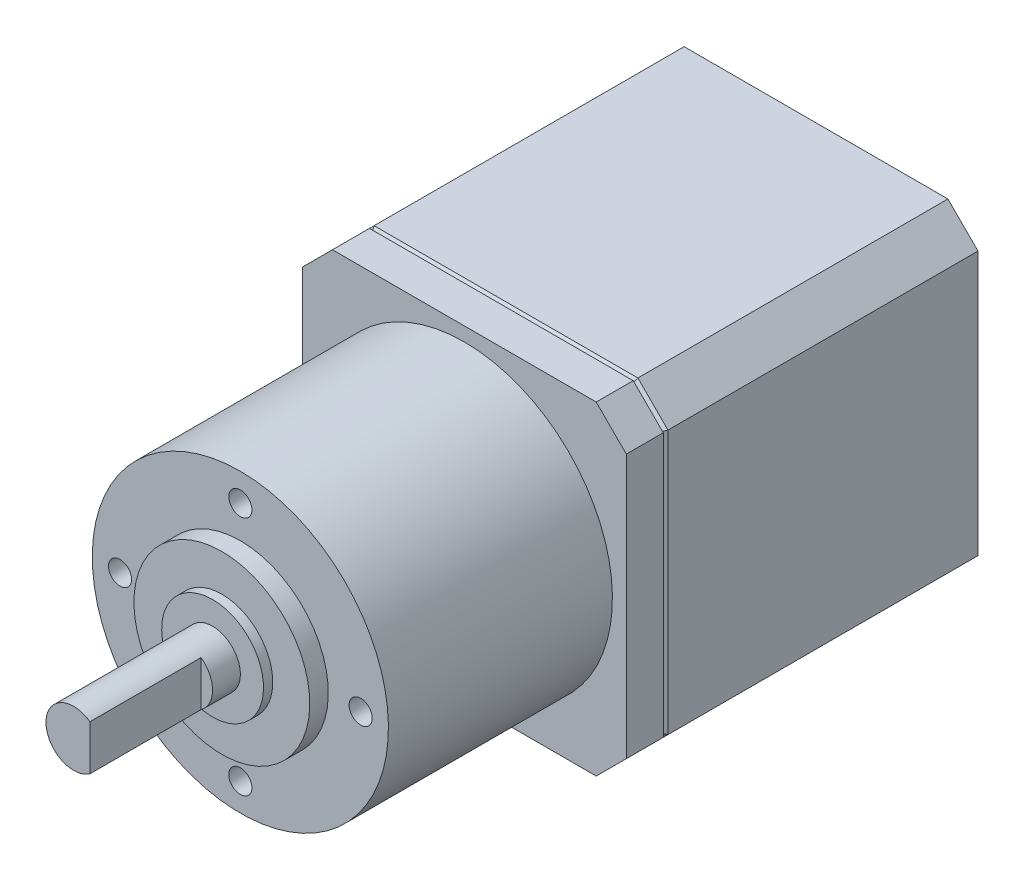
ISO-10303-21;
HEADER;
FILE_DESCRIPTION(('STEP AP214'),'2;1');
FILE_NAME('part.step','',(''),(''),'','','');
FILE_SCHEMA(('AUTOMOTIVE_DESIGN { 1 0 10303 214 1 1 1 1 }'));
ENDSEC;
DATA;
#1=APPLICATION_CONTEXT('core data for automotive mechanical design processes');
#2=APPLICATION_PROTOCOL_DEFINITION('international standard','automotive_design',2000,#1);
#3=PRODUCT_CONTEXT('',#1,'mechanical');
#4=PRODUCT('Part','Part','',(#3));
#5=PRODUCT_RELATED_PRODUCT_CATEGORY('part','',(#4));
#6=PRODUCT_DEFINITION_FORMATION('','',#4);
#7=PRODUCT_DEFINITION_CONTEXT('part definition',#1,'design');
#8=PRODUCT_DEFINITION('design','',#6,#7);
#9=PRODUCT_DEFINITION_SHAPE('','',#8);
#10=(LENGTH_UNIT() NAMED_UNIT(*) SI_UNIT(.MILLI.,.METRE.));
#11=(NAMED_UNIT(*) PLANE_ANGLE_UNIT() SI_UNIT($,.RADIAN.));
#12=(NAMED_UNIT(*) SI_UNIT($,.STERADIAN.) SOLID_ANGLE_UNIT());
#13=UNCERTAINTY_MEASURE_WITH_UNIT(LENGTH_MEASURE(1.E-05),#10,'distance_accuracy_value','');
#14=(GEOMETRIC_REPRESENTATION_CONTEXT(3) GLOBAL_UNCERTAINTY_ASSIGNED_CONTEXT((#13)) GLOBAL_UNIT_ASSIGNED_CONTEXT((#10,
#11,#12)) REPRESENTATION_CONTEXT('',''));
#15=CARTESIAN_POINT('',(0.,0.,0.));
#16=DIRECTION('',(0.,0.,1.));
#17=DIRECTION('',(1.,0.,0.));
#18=AXIS2_PLACEMENT_3D('',#15,#16,#17);
#19=CARTESIAN_POINT('',(0.,0.,68.2));
#20=DIRECTION('',(0.,0.,1.));
#21=DIRECTION('',(1.,0.,0.));
#22=AXIS2_PLACEMENT_3D('',#19,#20,#21);
#23=PLANE('',#22);
#24=CARTESIAN_POINT('',(0.,0.,68.2));
#25=DIRECTION('',(0.,0.,-1.));
#26=DIRECTION('',(0.,1.,0.));
#27=AXIS2_PLACEMENT_3D('',#24,#25,#26);
#28=CIRCLE('',#27,3.);
#29=CARTESIAN_POINT('',(1.75,2.43669858620224,68.2));
#30=VERTEX_POINT('',#29);
#31=CARTESIAN_POINT('',(1.74999999999999,-2.43669858620225,68.2));
#32=VERTEX_POINT('',#31);
#33=EDGE_CURVE('P0_E20',#30,#32,#28,.T.);
#34=ORIENTED_EDGE('',*,*,#33,.F.);
#35=DIRECTION('',(0.,1.,0.));
#36=VECTOR('',#35,1.);
#37=CARTESIAN_POINT('',(1.75,2.43669858620224,68.2));
#38=LINE('',#37,#36);
#39=EDGE_CURVE('P0_E118',#30,#32,#38,.F.);
#40=ORIENTED_EDGE('',*,*,#39,.T.);
#41=EDGE_LOOP('',(#34,#40));
#42=FACE_BOUND('',#41,.T.);
#43=ADVANCED_FACE('P0_F17',(#42),#23,.T.);
#44=CARTESIAN_POINT('',(1.75,2.43669858620224,68.2));
#45=DIRECTION('',(-1.,0.,0.));
#46=DIRECTION('',(0.,0.,1.));
#47=AXIS2_PLACEMENT_3D('',#44,#45,#46);
#48=PLANE('',#47);
#49=DIRECTION('',(0.,0.,-1.));
#50=VECTOR('',#49,1.);
#51=CARTESIAN_POINT('',(1.74999999999999,-2.43669858620225,38.));
#52=LINE('',#51,#50);
#53=CARTESIAN_POINT('',(1.74999999999999,-2.43669858620225,80.2));
#54=VERTEX_POINT('',#53);
#55=EDGE_CURVE('P0_E112',#32,#54,#52,.F.);
#56=ORIENTED_EDGE('',*,*,#55,.F.);
#57=ORIENTED_EDGE('',*,*,#39,.F.);
#58=DIRECTION('',(0.,0.,-1.));
#59=VECTOR('',#58,1.);
#60=CARTESIAN_POINT('',(1.75,2.43669858620224,38.));
#61=LINE('',#60,#59);
#62=CARTESIAN_POINT('',(1.75,2.43669858620224,80.2));
#63=VERTEX_POINT('',#62);
#64=EDGE_CURVE('P0_E117',#63,#30,#61,.T.);
#65=ORIENTED_EDGE('',*,*,#64,.F.);
#66=DIRECTION('',(0.,-1.,0.));
#67=VECTOR('',#66,1.);
#68=CARTESIAN_POINT('',(1.75,0.,80.2));
#69=LINE('',#68,#67);
#70=EDGE_CURVE('P0_E109',#54,#63,#69,.F.);
#71=ORIENTED_EDGE('',*,*,#70,.F.);
#72=EDGE_LOOP('',(#56,#57,#65,#71));
#73=FACE_BOUND('',#72,.T.);
#74=ADVANCED_FACE('P0_F115',(#73),#48,.F.);
#75=CARTESIAN_POINT('',(0.,0.,80.2));
#76=DIRECTION('',(0.,0.,1.));
#77=DIRECTION('',(0.,-1.,0.));
#78=AXIS2_PLACEMENT_3D('',#75,#76,#77);
#79=PLANE('',#78);
#80=CARTESIAN_POINT('',(0.,0.,80.2));
#81=DIRECTION('',(0.,0.,-1.));
#82=DIRECTION('',(0.,1.,0.));
#83=AXIS2_PLACEMENT_3D('',#80,#81,#82);
#84=CIRCLE('',#83,3.);
#85=EDGE_CURVE('P0_E104',#54,#63,#84,.T.);
#86=ORIENTED_EDGE('',*,*,#85,.F.);
#87=ORIENTED_EDGE('',*,*,#70,.T.);
#88=EDGE_LOOP('',(#86,#87));
#89=FACE_BOUND('',#88,.T.);
#90=ADVANCED_FACE('P0_F108',(#89),#79,.T.);
#91=CARTESIAN_POINT('',(0.,0.,38.));
#92=DIRECTION('',(0.,0.,-1.));
#93=DIRECTION('',(0.,1.,0.));
#94=AXIS2_PLACEMENT_3D('',#91,#92,#93);
#95=CYLINDRICAL_SURFACE('',#94,3.);
#96=ORIENTED_EDGE('',*,*,#55,.T.);
#97=ORIENTED_EDGE('',*,*,#85,.T.);
#98=ORIENTED_EDGE('',*,*,#64,.T.);
#99=ORIENTED_EDGE('',*,*,#33,.T.);
#100=EDGE_LOOP('',(#96,#97,#98,#99));
#101=FACE_BOUND('',#100,.T.);
#102=CARTESIAN_POINT('',(0.,0.,65.2));
#103=DIRECTION('',(0.,0.,-1.));
#104=DIRECTION('',(0.,1.,0.));
#105=AXIS2_PLACEMENT_3D('',#102,#103,#104);
#106=CIRCLE('',#105,3.);
#107=CARTESIAN_POINT('',(0.,3.,65.2));
#108=VERTEX_POINT('',#107);
#109=EDGE_CURVE('P0_E111',#108,#108,#106,.T.);
#110=ORIENTED_EDGE('',*,*,#109,.F.);
#111=EDGE_LOOP('',(#110));
#112=FACE_BOUND('',#111,.T.);
#113=ADVANCED_FACE('P0_F120',(#101,#112),#95,.T.);
#114=CARTESIAN_POINT('',(0.,2.99999999999999,65.2));
#115=DIRECTION('',(0.,0.,1.));
#116=DIRECTION('',(0.,-1.,0.));
#117=AXIS2_PLACEMENT_3D('',#114,#115,#116);
#118=PLANE('',#117);
#119=CARTESIAN_POINT('',(0.,0.,65.2));
#120=DIRECTION('',(0.,0.,-1.));
#121=DIRECTION('',(0.,1.,0.));
#122=AXIS2_PLACEMENT_3D('',#119,#120,#121);
#123=CIRCLE('',#122,5.5);
#124=CARTESIAN_POINT('',(0.,5.5,65.2));
#125=VERTEX_POINT('',#124);
#126=EDGE_CURVE('P0_E156',#125,#125,#123,.T.);
#127=ORIENTED_EDGE('',*,*,#126,.F.);
#128=EDGE_LOOP('',(#127));
#129=FACE_BOUND('',#128,.T.);
#130=ORIENTED_EDGE('',*,*,#109,.T.);
#131=EDGE_LOOP('',(#130));
#132=FACE_BOUND('',#131,.T.);
#133=ADVANCED_FACE('P0_F162',(#129,#132),#118,.T.);
#134=CARTESIAN_POINT('',(0.,0.,38.));
#135=DIRECTION('',(0.,0.,-1.));
#136=DIRECTION('',(0.,1.,0.));
#137=AXIS2_PLACEMENT_3D('',#134,#135,#136);
#138=CYLINDRICAL_SURFACE('',#137,5.5);
#139=ORIENTED_EDGE('',*,*,#126,.T.);
#140=EDGE_LOOP('',(#139));
#141=FACE_BOUND('',#140,.T.);
#142=CARTESIAN_POINT('',(0.,0.,64.2));
#143=DIRECTION('',(0.,0.,-1.));
#144=DIRECTION('',(0.,1.,0.));
#145=AXIS2_PLACEMENT_3D('',#142,#143,#144);
#146=CIRCLE('',#145,5.5);
#147=CARTESIAN_POINT('',(0.,5.5,64.2));
#148=VERTEX_POINT('',#147);
#149=EDGE_CURVE('P0_E152',#148,#148,#146,.T.);
#150=ORIENTED_EDGE('',*,*,#149,.F.);
#151=EDGE_LOOP('',(#150));
#152=FACE_BOUND('',#151,.T.);
#153=ADVANCED_FACE('P0_F170',(#141,#152),#138,.T.);
#154=CARTESIAN_POINT('',(0.,13.,57.1999999999662));
#155=DIRECTION('',(0.,0.,1.));
#156=DIRECTION('',(0.,-1.,0.));
#157=AXIS2_PLACEMENT_3D('',#154,#155,#156);
#158=CONICAL_SURFACE('',#157,1.2499999999136,1.0297442586752);
#159=CARTESIAN_POINT('',(-5.6843418860808E-11,13.,56.4489242262027));
#160=VERTEX_POINT('',#159);
#161=VERTEX_LOOP('',#160);
#162=FACE_BOUND('',#161,.T.);
#163=CARTESIAN_POINT('',(0.,13.,57.2));
#164=DIRECTION('',(0.,0.,1.));
#165=DIRECTION('',(1.,0.,0.));
#166=AXIS2_PLACEMENT_3D('',#163,#164,#165);
#167=CIRCLE('',#166,1.25);
#168=CARTESIAN_POINT('',(1.25,13.,57.2));
#169=VERTEX_POINT('',#168);
#170=EDGE_CURVE('P0_E155',#169,#169,#167,.T.);
#171=ORIENTED_EDGE('',*,*,#170,.T.);
#172=EDGE_LOOP('',(#171));
#173=FACE_BOUND('',#172,.T.);
#174=ADVANCED_FACE('P0_F260',(#162,#173),#158,.F.);
#175=CARTESIAN_POINT('',(13.,0.,57.200000000023));
#176=DIRECTION('',(0.,0.,1.));
#177=DIRECTION('',(1.,0.,0.));
#178=AXIS2_PLACEMENT_3D('',#175,#176,#177);
#179=CONICAL_SURFACE('',#178,1.25000000000409,1.02974425861207);
#180=CARTESIAN_POINT('',(13.0000000000052,0.,56.4489242262312));
#181=VERTEX_POINT('',#180);
#182=VERTEX_LOOP('',#181);
#183=FACE_BOUND('',#182,.T.);
#184=CARTESIAN_POINT('',(13.,0.,57.2));
#185=DIRECTION('',(0.,0.,1.));
#186=DIRECTION('',(1.,0.,0.));
#187=AXIS2_PLACEMENT_3D('',#184,#185,#186);
#188=CIRCLE('',#187,1.25);
#189=CARTESIAN_POINT('',(14.25,0.,57.2));
#190=VERTEX_POINT('',#189);
#191=EDGE_CURVE('P0_E449',#190,#190,#188,.T.);
#192=ORIENTED_EDGE('',*,*,#191,.T.);
#193=EDGE_LOOP('',(#192));
#194=FACE_BOUND('',#193,.T.);
#195=ADVANCED_FACE('P0_F256',(#183,#194),#179,.F.);
#196=CARTESIAN_POINT('',(0.,-13.,57.1999999999662));
#197=DIRECTION('',(0.,0.,1.));
#198=DIRECTION('',(0.,-1.,0.));
#199=AXIS2_PLACEMENT_3D('',#196,#197,#198);
#200=CONICAL_SURFACE('',#199,1.2499999999136,1.0297442586752);
#201=CARTESIAN_POINT('',(-5.6843418860808E-11,-13.,56.4489242262027));
#202=VERTEX_POINT('',#201);
#203=VERTEX_LOOP('',#202);
#204=FACE_BOUND('',#203,.T.);
#205=CARTESIAN_POINT('',(0.,-13.,57.2));
#206=DIRECTION('',(0.,0.,1.));
#207=DIRECTION('',(1.,0.,0.));
#208=AXIS2_PLACEMENT_3D('',#205,#206,#207);
#209=CIRCLE('',#208,1.25);
#210=CARTESIAN_POINT('',(1.25,-13.,57.2));
#211=VERTEX_POINT('',#210);
#212=EDGE_CURVE('P0_E452',#211,#211,#209,.T.);
#213=ORIENTED_EDGE('',*,*,#212,.T.);
#214=EDGE_LOOP('',(#213));
#215=FACE_BOUND('',#214,.T.);
#216=ADVANCED_FACE('P0_F252',(#204,#215),#200,.F.);
#217=CARTESIAN_POINT('',(-13.,0.,57.200000000023));
#218=DIRECTION('',(0.,0.,1.));
#219=DIRECTION('',(1.,0.,0.));
#220=AXIS2_PLACEMENT_3D('',#217,#218,#219);
#221=CONICAL_SURFACE('',#220,1.24999999999363,1.02974425865817);
#222=CARTESIAN_POINT('',(-12.9999999998915,0.,56.4489242262312));
#223=VERTEX_POINT('',#222);
#224=VERTEX_LOOP('',#223);
#225=FACE_BOUND('',#224,.T.);
#226=CARTESIAN_POINT('',(-13.,0.,57.2));
#227=DIRECTION('',(0.,0.,1.));
#228=DIRECTION('',(1.,0.,0.));
#229=AXIS2_PLACEMENT_3D('',#226,#227,#228);
#230=CIRCLE('',#229,1.25);
#231=CARTESIAN_POINT('',(-11.75,0.,57.2));
#232=VERTEX_POINT('',#231);
#233=EDGE_CURVE('P0_E151',#232,#232,#230,.T.);
#234=ORIENTED_EDGE('',*,*,#233,.T.);
#235=EDGE_LOOP('',(#234));
#236=FACE_BOUND('',#235,.T.);
#237=ADVANCED_FACE('P0_F248',(#225,#236),#221,.F.);
#238=CARTESIAN_POINT('',(0.,5.5,64.2));
#239=DIRECTION('',(0.,0.,1.));
#240=DIRECTION('',(0.,-1.,0.));
#241=AXIS2_PLACEMENT_3D('',#238,#239,#240);
#242=PLANE('',#241);
#243=CARTESIAN_POINT('',(0.,0.,64.2));
#244=DIRECTION('',(0.,0.,-1.));
#245=DIRECTION('',(0.,1.,0.));
#246=AXIS2_PLACEMENT_3D('',#243,#244,#245);
#247=CIRCLE('',#246,9.5);
#248=CARTESIAN_POINT('',(0.,9.5,64.2));
#249=VERTEX_POINT('',#248);
#250=EDGE_CURVE('P0_E147',#249,#249,#247,.T.);
#251=ORIENTED_EDGE('',*,*,#250,.F.);
#252=EDGE_LOOP('',(#251));
#253=FACE_BOUND('',#252,.T.);
#254=ORIENTED_EDGE('',*,*,#149,.T.);
#255=EDGE_LOOP('',(#254));
#256=FACE_BOUND('',#255,.T.);
#257=ADVANCED_FACE('P0_F244',(#253,#256),#242,.T.);
#258=CARTESIAN_POINT('',(0.,0.,34.));
#259=DIRECTION('',(0.,0.,1.));
#260=DIRECTION('',(1.,0.,0.));
#261=AXIS2_PLACEMENT_3D('',#258,#259,#260);
#262=PLANE('',#261);
#263=DIRECTION('',(-0.707106781186548,-0.707106781186548,0.));
#264=VECTOR('',#263,1.);
#265=CARTESIAN_POINT('',(14.25,-17.5,34.));
#266=LINE('',#265,#264);
#267=CARTESIAN_POINT('',(17.5,-14.25,34.));
#268=VERTEX_POINT('',#267);
#269=CARTESIAN_POINT('',(14.25,-17.5,34.));
#270=VERTEX_POINT('',#269);
#271=EDGE_CURVE('P0_E146',#268,#270,#266,.T.);
#272=ORIENTED_EDGE('',*,*,#271,.T.);
#273=DIRECTION('',(-1.,0.,0.));
#274=VECTOR('',#273,1.);
#275=CARTESIAN_POINT('',(-14.25,-17.5,34.));
#276=LINE('',#275,#274);
#277=CARTESIAN_POINT('',(-14.25,-17.5,34.));
#278=VERTEX_POINT('',#277);
#279=EDGE_CURVE('P0_E487',#270,#278,#276,.T.);
#280=ORIENTED_EDGE('',*,*,#279,.T.);
#281=DIRECTION('',(-0.707106781186548,0.707106781186548,0.));
#282=VECTOR('',#281,1.);
#283=CARTESIAN_POINT('',(-17.5,-14.25,34.));
#284=LINE('',#283,#282);
#285=CARTESIAN_POINT('',(-17.5,-14.25,34.));
#286=VERTEX_POINT('',#285);
#287=EDGE_CURVE('P0_E482',#278,#286,#284,.T.);
#288=ORIENTED_EDGE('',*,*,#287,.T.);
#289=DIRECTION('',(0.,1.,0.));
#290=VECTOR('',#289,1.);
#291=CARTESIAN_POINT('',(-17.5,14.25,34.));
#292=LINE('',#291,#290);
#293=CARTESIAN_POINT('',(-17.5,14.25,34.));
#294=VERTEX_POINT('',#293);
#295=EDGE_CURVE('P0_E477',#286,#294,#292,.T.);
#296=ORIENTED_EDGE('',*,*,#295,.T.);
#297=DIRECTION('',(0.707106781186548,0.707106781186548,0.));
#298=VECTOR('',#297,1.);
#299=CARTESIAN_POINT('',(-14.25,17.5,34.));
#300=LINE('',#299,#298);
#301=CARTESIAN_POINT('',(-14.25,17.5,34.));
#302=VERTEX_POINT('',#301);
#303=EDGE_CURVE('P0_E472',#294,#302,#300,.T.);
#304=ORIENTED_EDGE('',*,*,#303,.T.);
#305=DIRECTION('',(1.,0.,0.));
#306=VECTOR('',#305,1.);
#307=CARTESIAN_POINT('',(14.25,17.5,34.));
#308=LINE('',#307,#306);
#309=CARTESIAN_POINT('',(14.25,17.5,34.));
#310=VERTEX_POINT('',#309);
#311=EDGE_CURVE('P0_E467',#302,#310,#308,.T.);
#312=ORIENTED_EDGE('',*,*,#311,.T.);
#313=DIRECTION('',(0.707106781186548,-0.707106781186548,0.));
#314=VECTOR('',#313,1.);
#315=CARTESIAN_POINT('',(17.5,14.25,34.));
#316=LINE('',#315,#314);
#317=CARTESIAN_POINT('',(17.5,14.25,34.));
#318=VERTEX_POINT('',#317);
#319=EDGE_CURVE('P0_E462',#310,#318,#316,.T.);
#320=ORIENTED_EDGE('',*,*,#319,.T.);
#321=DIRECTION('',(0.,1.,0.));
#322=VECTOR('',#321,1.);
#323=CARTESIAN_POINT('',(17.5,-14.25,34.));
#324=LINE('',#323,#322);
#325=EDGE_CURVE('P0_E150',#318,#268,#324,.F.);
#326=ORIENTED_EDGE('',*,*,#325,.T.);
#327=EDGE_LOOP('',(#272,#280,#288,#296,#304,#312,#320,#326));
#328=FACE_BOUND('',#327,.T.);
#329=ADVANCED_FACE('P0_F240',(#328),#262,.F.);
#330=CARTESIAN_POINT('',(0.,13.,62.2));
#331=DIRECTION('',(0.,0.,1.));
#332=DIRECTION('',(1.,0.,0.));
#333=AXIS2_PLACEMENT_3D('',#330,#331,#332);
#334=CYLINDRICAL_SURFACE('',#333,1.25);
#335=CARTESIAN_POINT('',(0.,13.,62.2));
#336=DIRECTION('',(0.,0.,1.));
#337=DIRECTION('',(1.,0.,0.));
#338=AXIS2_PLACEMENT_3D('',#335,#336,#337);
#339=CIRCLE('',#338,1.25);
#340=CARTESIAN_POINT('',(1.25,13.,62.2));
#341=VERTEX_POINT('',#340);
#342=EDGE_CURVE('P0_E143',#341,#341,#339,.F.);
#343=ORIENTED_EDGE('',*,*,#342,.F.);
#344=EDGE_LOOP('',(#343));
#345=FACE_BOUND('',#344,.T.);
#346=ORIENTED_EDGE('',*,*,#170,.F.);
#347=EDGE_LOOP('',(#346));
#348=FACE_BOUND('',#347,.T.);
#349=ADVANCED_FACE('P0_F236',(#345,#348),#334,.F.);
#350=CARTESIAN_POINT('',(13.,0.,62.2));
#351=DIRECTION('',(0.,0.,1.));
#352=DIRECTION('',(1.,0.,0.));
#353=AXIS2_PLACEMENT_3D('',#350,#351,#352);
#354=CYLINDRICAL_SURFACE('',#353,1.25);
#355=CARTESIAN_POINT('',(13.,0.,62.2));
#356=DIRECTION('',(0.,0.,1.));
#357=DIRECTION('',(1.,0.,0.));
#358=AXIS2_PLACEMENT_3D('',#355,#356,#357);
#359=CIRCLE('',#358,1.25);
#360=CARTESIAN_POINT('',(14.25,0.,62.2));
#361=VERTEX_POINT('',#360);
#362=EDGE_CURVE('P0_E140',#361,#361,#359,.F.);
#363=ORIENTED_EDGE('',*,*,#362,.F.);
#364=EDGE_LOOP('',(#363));
#365=FACE_BOUND('',#364,.T.);
#366=ORIENTED_EDGE('',*,*,#191,.F.);
#367=EDGE_LOOP('',(#366));
#368=FACE_BOUND('',#367,.T.);
#369=ADVANCED_FACE('P0_F232',(#365,#368),#354,.F.);
#370=CARTESIAN_POINT('',(0.,-13.,62.2));
#371=DIRECTION('',(0.,0.,1.));
#372=DIRECTION('',(1.,0.,0.));
#373=AXIS2_PLACEMENT_3D('',#370,#371,#372);
#374=CYLINDRICAL_SURFACE('',#373,1.25);
#375=CARTESIAN_POINT('',(0.,-13.,62.2));
#376=DIRECTION('',(0.,0.,1.));
#377=DIRECTION('',(1.,0.,0.));
#378=AXIS2_PLACEMENT_3D('',#375,#376,#377);
#379=CIRCLE('',#378,1.25);
#380=CARTESIAN_POINT('',(1.25,-13.,62.2));
#381=VERTEX_POINT('',#380);
#382=EDGE_CURVE('P0_E137',#381,#381,#379,.F.);
#383=ORIENTED_EDGE('',*,*,#382,.F.);
#384=EDGE_LOOP('',(#383));
#385=FACE_BOUND('',#384,.T.);
#386=ORIENTED_EDGE('',*,*,#212,.F.);
#387=EDGE_LOOP('',(#386));
#388=FACE_BOUND('',#387,.T.);
#389=ADVANCED_FACE('P0_F228',(#385,#388),#374,.F.);
#390=CARTESIAN_POINT('',(-13.,0.,62.2));
#391=DIRECTION('',(0.,0.,1.));
#392=DIRECTION('',(1.,0.,0.));
#393=AXIS2_PLACEMENT_3D('',#390,#391,#392);
#394=CYLINDRICAL_SURFACE('',#393,1.25);
#395=CARTESIAN_POINT('',(-13.,0.,62.2));
#396=DIRECTION('',(0.,0.,1.));
#397=DIRECTION('',(1.,0.,0.));
#398=AXIS2_PLACEMENT_3D('',#395,#396,#397);
#399=CIRCLE('',#398,1.25);
#400=CARTESIAN_POINT('',(-11.75,0.,62.2));
#401=VERTEX_POINT('',#400);
#402=EDGE_CURVE('P0_E134',#401,#401,#399,.F.);
#403=ORIENTED_EDGE('',*,*,#402,.F.);
#404=EDGE_LOOP('',(#403));
#405=FACE_BOUND('',#404,.T.);
#406=ORIENTED_EDGE('',*,*,#233,.F.);
#407=EDGE_LOOP('',(#406));
#408=FACE_BOUND('',#407,.T.);
#409=ADVANCED_FACE('P0_F224',(#405,#408),#394,.F.);
#410=CARTESIAN_POINT('',(0.,0.,38.));
#411=DIRECTION('',(0.,0.,-1.));
#412=DIRECTION('',(0.,1.,0.));
#413=AXIS2_PLACEMENT_3D('',#410,#411,#412);
#414=CYLINDRICAL_SURFACE('',#413,9.5);
#415=ORIENTED_EDGE('',*,*,#250,.T.);
#416=EDGE_LOOP('',(#415));
#417=FACE_BOUND('',#416,.T.);
#418=CARTESIAN_POINT('',(0.,0.,62.2));
#419=DIRECTION('',(0.,0.,-1.));
#420=DIRECTION('',(0.,1.,0.));
#421=AXIS2_PLACEMENT_3D('',#418,#419,#420);
#422=CIRCLE('',#421,9.5);
#423=CARTESIAN_POINT('',(0.,9.5,62.2));
#424=VERTEX_POINT('',#423);
#425=EDGE_CURVE('P0_E130',#424,#424,#422,.T.);
#426=ORIENTED_EDGE('',*,*,#425,.F.);
#427=EDGE_LOOP('',(#426));
#428=FACE_BOUND('',#427,.T.);
#429=ADVANCED_FACE('P0_F220',(#417,#428),#414,.T.);
#430=CARTESIAN_POINT('',(17.5,-14.25,38.));
#431=DIRECTION('',(-1.,0.,0.));
#432=DIRECTION('',(0.,0.,1.));
#433=AXIS2_PLACEMENT_3D('',#430,#431,#432);
#434=PLANE('',#433);
#435=DIRECTION('',(0.,0.,1.));
#436=VECTOR('',#435,1.);
#437=CARTESIAN_POINT('',(17.5,14.25,38.));
#438=LINE('',#437,#436);
#439=CARTESIAN_POINT('',(17.5,14.25,38.));
#440=VERTEX_POINT('',#439);
#441=EDGE_CURVE('P0_E460',#318,#440,#438,.T.);
#442=ORIENTED_EDGE('',*,*,#441,.T.);
#443=DIRECTION('',(0.,1.,0.));
#444=VECTOR('',#443,1.);
#445=CARTESIAN_POINT('',(17.5,0.,38.));
#446=LINE('',#445,#444);
#447=CARTESIAN_POINT('',(17.5,-14.25,38.));
#448=VERTEX_POINT('',#447);
#449=EDGE_CURVE('P0_E133',#448,#440,#446,.T.);
#450=ORIENTED_EDGE('',*,*,#449,.F.);
#451=DIRECTION('',(0.,0.,1.));
#452=VECTOR('',#451,1.);
#453=CARTESIAN_POINT('',(17.5,-14.25,38.));
#454=LINE('',#453,#452);
#455=EDGE_CURVE('P0_E491',#448,#268,#454,.F.);
#456=ORIENTED_EDGE('',*,*,#455,.T.);
#457=ORIENTED_EDGE('',*,*,#325,.F.);
#458=EDGE_LOOP('',(#442,#450,#456,#457));
#459=FACE_BOUND('',#458,.T.);
#460=ADVANCED_FACE('P0_F216',(#459),#434,.F.);
#461=CARTESIAN_POINT('',(17.5,14.25,38.));
#462=DIRECTION('',(-0.707106781186548,-0.707106781186548,0.));
#463=DIRECTION('',(0.707106781186548,-0.707106781186548,0.));
#464=AXIS2_PLACEMENT_3D('',#461,#462,#463);
#465=PLANE('',#464);
#466=DIRECTION('',(0.,0.,1.));
#467=VECTOR('',#466,1.);
#468=CARTESIAN_POINT('',(14.25,17.5,38.));
#469=LINE('',#468,#467);
#470=CARTESIAN_POINT('',(14.25,17.5,38.));
#471=VERTEX_POINT('',#470);
#472=EDGE_CURVE('P0_E465',#310,#471,#469,.T.);
#473=ORIENTED_EDGE('',*,*,#472,.T.);
#474=DIRECTION('',(-0.707106781186547,0.707106781186547,0.));
#475=VECTOR('',#474,1.);
#476=CARTESIAN_POINT('',(17.5,14.25,38.));
#477=LINE('',#476,#475);
#478=EDGE_CURVE('P0_E498',#440,#471,#477,.T.);
#479=ORIENTED_EDGE('',*,*,#478,.F.);
#480=ORIENTED_EDGE('',*,*,#441,.F.);
#481=ORIENTED_EDGE('',*,*,#319,.F.);
#482=EDGE_LOOP('',(#473,#479,#480,#481));
#483=FACE_BOUND('',#482,.T.);
#484=ADVANCED_FACE('P0_F212',(#483),#465,.F.);
#485=CARTESIAN_POINT('',(14.25,17.5,38.));
#486=DIRECTION('',(0.,-1.,0.));
#487=DIRECTION('',(1.,0.,0.));
#488=AXIS2_PLACEMENT_3D('',#485,#486,#487);
#489=PLANE('',#488);
#490=DIRECTION('',(0.,0.,1.));
#491=VECTOR('',#490,1.);
#492=CARTESIAN_POINT('',(-14.25,17.5,38.));
#493=LINE('',#492,#491);
#494=CARTESIAN_POINT('',(-14.25,17.5,38.));
#495=VERTEX_POINT('',#494);
#496=EDGE_CURVE('P0_E470',#302,#495,#493,.T.);
#497=ORIENTED_EDGE('',*,*,#496,.T.);
#498=DIRECTION('',(1.,0.,0.));
#499=VECTOR('',#498,1.);
#500=CARTESIAN_POINT('',(0.,17.5,38.));
#501=LINE('',#500,#499);
#502=EDGE_CURVE('P0_E501',#471,#495,#501,.F.);
#503=ORIENTED_EDGE('',*,*,#502,.F.);
#504=ORIENTED_EDGE('',*,*,#472,.F.);
#505=ORIENTED_EDGE('',*,*,#311,.F.);
#506=EDGE_LOOP('',(#497,#503,#504,#505));
#507=FACE_BOUND('',#506,.T.);
#508=ADVANCED_FACE('P0_F208',(#507),#489,.F.);
#509=CARTESIAN_POINT('',(-14.25,17.5,38.));
#510=DIRECTION('',(0.707106781186548,-0.707106781186548,0.));
#511=DIRECTION('',(0.707106781186548,0.707106781186548,0.));
#512=AXIS2_PLACEMENT_3D('',#509,#510,#511);
#513=PLANE('',#512);
#514=DIRECTION('',(0.,0.,-1.));
#515=VECTOR('',#514,1.);
#516=CARTESIAN_POINT('',(-17.5,14.25,38.));
#517=LINE('',#516,#515);
#518=CARTESIAN_POINT('',(-17.5,14.25,38.));
#519=VERTEX_POINT('',#518);
#520=EDGE_CURVE('P0_E475',#294,#519,#517,.F.);
#521=ORIENTED_EDGE('',*,*,#520,.T.);
#522=DIRECTION('',(-0.707106781186547,-0.707106781186547,0.));
#523=VECTOR('',#522,1.);
#524=CARTESIAN_POINT('',(-14.25,17.5,38.));
#525=LINE('',#524,#523);
#526=EDGE_CURVE('P0_E504',#495,#519,#525,.T.);
#527=ORIENTED_EDGE('',*,*,#526,.F.);
#528=ORIENTED_EDGE('',*,*,#496,.F.);
#529=ORIENTED_EDGE('',*,*,#303,.F.);
#530=EDGE_LOOP('',(#521,#527,#528,#529));
#531=FACE_BOUND('',#530,.T.);
#532=ADVANCED_FACE('P0_F204',(#531),#513,.F.);
#533=CARTESIAN_POINT('',(-17.5,14.25,38.));
#534=DIRECTION('',(1.,0.,0.));
#535=DIRECTION('',(0.,0.,-1.));
#536=AXIS2_PLACEMENT_3D('',#533,#534,#535);
#537=PLANE('',#536);
#538=DIRECTION('',(0.,0.,1.));
#539=VECTOR('',#538,1.);
#540=CARTESIAN_POINT('',(-17.5,-14.25,38.));
#541=LINE('',#540,#539);
#542=CARTESIAN_POINT('',(-17.5,-14.25,38.));
#543=VERTEX_POINT('',#542);
#544=EDGE_CURVE('P0_E480',#286,#543,#541,.T.);
#545=ORIENTED_EDGE('',*,*,#544,.T.);
#546=DIRECTION('',(0.,1.,0.));
#547=VECTOR('',#546,1.);
#548=CARTESIAN_POINT('',(-17.5,0.,38.));
#549=LINE('',#548,#547);
#550=EDGE_CURVE('P0_E507',#519,#543,#549,.F.);
#551=ORIENTED_EDGE('',*,*,#550,.F.);
#552=ORIENTED_EDGE('',*,*,#520,.F.);
#553=ORIENTED_EDGE('',*,*,#295,.F.);
#554=EDGE_LOOP('',(#545,#551,#552,#553));
#555=FACE_BOUND('',#554,.T.);
#556=ADVANCED_FACE('P0_F200',(#555),#537,.F.);
#557=CARTESIAN_POINT('',(-17.5,-14.25,38.));
#558=DIRECTION('',(0.707106781186548,0.707106781186548,0.));
#559=DIRECTION('',(-0.707106781186548,0.707106781186548,0.));
#560=AXIS2_PLACEMENT_3D('',#557,#558,#559);
#561=PLANE('',#560);
#562=DIRECTION('',(0.,0.,1.));
#563=VECTOR('',#562,1.);
#564=CARTESIAN_POINT('',(-14.25,-17.5,38.));
#565=LINE('',#564,#563);
#566=CARTESIAN_POINT('',(-14.25,-17.5,38.));
#567=VERTEX_POINT('',#566);
#568=EDGE_CURVE('P0_E485',#278,#567,#565,.T.);
#569=ORIENTED_EDGE('',*,*,#568,.T.);
#570=DIRECTION('',(0.707106781186547,-0.707106781186547,0.));
#571=VECTOR('',#570,1.);
#572=CARTESIAN_POINT('',(-17.5,-14.25,38.));
#573=LINE('',#572,#571);
#574=EDGE_CURVE('P0_E510',#543,#567,#573,.T.);
#575=ORIENTED_EDGE('',*,*,#574,.F.);
#576=ORIENTED_EDGE('',*,*,#544,.F.);
#577=ORIENTED_EDGE('',*,*,#287,.F.);
#578=EDGE_LOOP('',(#569,#575,#576,#577));
#579=FACE_BOUND('',#578,.T.);
#580=ADVANCED_FACE('P0_F197',(#579),#561,.F.);
#581=CARTESIAN_POINT('',(-14.25,-17.5,38.));
#582=DIRECTION('',(0.,1.,0.));
#583=DIRECTION('',(-1.,0.,0.));
#584=AXIS2_PLACEMENT_3D('',#581,#582,#583);
#585=PLANE('',#584);
#586=DIRECTION('',(0.,0.,1.));
#587=VECTOR('',#586,1.);
#588=CARTESIAN_POINT('',(14.25,-17.5,38.));
#589=LINE('',#588,#587);
#590=CARTESIAN_POINT('',(14.25,-17.5,38.));
#591=VERTEX_POINT('',#590);
#592=EDGE_CURVE('P0_E35',#270,#591,#589,.T.);
#593=ORIENTED_EDGE('',*,*,#592,.T.);
#594=DIRECTION('',(1.,0.,0.));
#595=VECTOR('',#594,1.);
#596=CARTESIAN_POINT('',(0.,-17.5,38.));
#597=LINE('',#596,#595);
#598=EDGE_CURVE('P0_E513',#567,#591,#597,.T.);
#599=ORIENTED_EDGE('',*,*,#598,.F.);
#600=ORIENTED_EDGE('',*,*,#568,.F.);
#601=ORIENTED_EDGE('',*,*,#279,.F.);
#602=EDGE_LOOP('',(#593,#599,#600,#601));
#603=FACE_BOUND('',#602,.T.);
#604=ADVANCED_FACE('P0_F193',(#603),#585,.F.);
#605=CARTESIAN_POINT('',(14.25,-17.5,38.));
#606=DIRECTION('',(-0.707106781186548,0.707106781186548,0.));
#607=DIRECTION('',(-0.707106781186548,-0.707106781186548,0.));
#608=AXIS2_PLACEMENT_3D('',#605,#606,#607);
#609=PLANE('',#608);
#610=ORIENTED_EDGE('',*,*,#455,.F.);
#611=DIRECTION('',(0.707106781186547,0.707106781186548,0.));
#612=VECTOR('',#611,1.);
#613=CARTESIAN_POINT('',(14.25,-17.5,38.));
#614=LINE('',#613,#612);
#615=EDGE_CURVE('P0_E129',#591,#448,#614,.T.);
#616=ORIENTED_EDGE('',*,*,#615,.F.);
#617=ORIENTED_EDGE('',*,*,#592,.F.);
#618=ORIENTED_EDGE('',*,*,#271,.F.);
#619=EDGE_LOOP('',(#610,#616,#617,#618));
#620=FACE_BOUND('',#619,.T.);
#621=ADVANCED_FACE('P0_F189',(#620),#609,.F.);
#622=CARTESIAN_POINT('',(0.,9.5,62.2));
#623=DIRECTION('',(0.,0.,1.));
#624=DIRECTION('',(0.,-1.,0.));
#625=AXIS2_PLACEMENT_3D('',#622,#623,#624);
#626=PLANE('',#625);
#627=CARTESIAN_POINT('',(0.,0.,62.2));
#628=DIRECTION('',(0.,0.,-1.));
#629=DIRECTION('',(0.,1.,0.));
#630=AXIS2_PLACEMENT_3D('',#627,#628,#629);
#631=CIRCLE('',#630,16.);
#632=CARTESIAN_POINT('',(0.,16.,62.2));
#633=VERTEX_POINT('',#632);
#634=EDGE_CURVE('P0_E26',#633,#633,#631,.T.);
#635=ORIENTED_EDGE('',*,*,#634,.F.);
#636=EDGE_LOOP('',(#635));
#637=FACE_BOUND('',#636,.T.);
#638=ORIENTED_EDGE('',*,*,#425,.T.);
#639=EDGE_LOOP('',(#638));
#640=FACE_BOUND('',#639,.T.);
#641=ORIENTED_EDGE('',*,*,#402,.T.);
#642=EDGE_LOOP('',(#641));
#643=FACE_BOUND('',#642,.T.);
#644=ORIENTED_EDGE('',*,*,#382,.T.);
#645=EDGE_LOOP('',(#644));
#646=FACE_BOUND('',#645,.T.);
#647=ORIENTED_EDGE('',*,*,#362,.T.);
#648=EDGE_LOOP('',(#647));
#649=FACE_BOUND('',#648,.T.);
#650=ORIENTED_EDGE('',*,*,#342,.T.);
#651=EDGE_LOOP('',(#650));
#652=FACE_BOUND('',#651,.T.);
#653=ADVANCED_FACE('P0_F182',(#637,#640,#643,#646,#649,#652),#626,.T.);
#654=CARTESIAN_POINT('',(0.,0.,38.));
#655=DIRECTION('',(0.,0.,1.));
#656=DIRECTION('',(1.,0.,0.));
#657=AXIS2_PLACEMENT_3D('',#654,#655,#656);
#658=PLANE('',#657);
#659=ORIENTED_EDGE('',*,*,#598,.T.);
#660=ORIENTED_EDGE('',*,*,#615,.T.);
#661=ORIENTED_EDGE('',*,*,#449,.T.);
#662=ORIENTED_EDGE('',*,*,#478,.T.);
#663=ORIENTED_EDGE('',*,*,#502,.T.);
#664=ORIENTED_EDGE('',*,*,#526,.T.);
#665=ORIENTED_EDGE('',*,*,#550,.T.);
#666=ORIENTED_EDGE('',*,*,#574,.T.);
#667=EDGE_LOOP('',(#659,#660,#661,#662,#663,#664,#665,#666));
#668=FACE_BOUND('',#667,.T.);
#669=CARTESIAN_POINT('',(0.,0.,38.));
#670=DIRECTION('',(0.,0.,-1.));
#671=DIRECTION('',(0.,1.,0.));
#672=AXIS2_PLACEMENT_3D('',#669,#670,#671);
#673=CIRCLE('',#672,16.);
#674=CARTESIAN_POINT('',(0.,16.,38.));
#675=VERTEX_POINT('',#674);
#676=EDGE_CURVE('P0_E11',#675,#675,#673,.F.);
#677=ORIENTED_EDGE('',*,*,#676,.F.);
#678=EDGE_LOOP('',(#677));
#679=FACE_BOUND('',#678,.T.);
#680=ADVANCED_FACE('P0_F176',(#668,#679),#658,.T.);
#681=CARTESIAN_POINT('',(0.,0.,38.));
#682=DIRECTION('',(0.,0.,-1.));
#683=DIRECTION('',(0.,1.,0.));
#684=AXIS2_PLACEMENT_3D('',#681,#682,#683);
#685=CYLINDRICAL_SURFACE('',#684,16.);
#686=ORIENTED_EDGE('',*,*,#634,.T.);
#687=EDGE_LOOP('',(#686));
#688=FACE_BOUND('',#687,.T.);
#689=ORIENTED_EDGE('',*,*,#676,.T.);
#690=EDGE_LOOP('',(#689));
#691=FACE_BOUND('',#690,.T.);
#692=ADVANCED_FACE('P0_F174',(#688,#691),#685,.T.);
#693=CLOSED_SHELL('',(#43,#74,#90,#113,#133,#153,#174,#195,#216,#237,#257,#329,#349,#369,#389,
#409,#429,#460,#484,#508,#532,#556,#580,#604,#621,#653,#680,#692));
#694=MANIFOLD_SOLID_BREP('P0_B1',#693);
#695=CARTESIAN_POINT('',(0.,0.,34.));
#696=DIRECTION('',(0.,0.,1.));
#697=DIRECTION('',(1.,0.,0.));
#698=AXIS2_PLACEMENT_3D('',#695,#696,#697);
#699=PLANE('',#698);
#700=DIRECTION('',(-0.707106781186548,-0.707106781186547,0.));
#701=VECTOR('',#700,1.);
#702=CARTESIAN_POINT('',(17.,-14.0428932188134,34.));
#703=LINE('',#702,#701);
#704=CARTESIAN_POINT('',(17.,-14.0428932188134,34.));
#705=VERTEX_POINT('',#704);
#706=CARTESIAN_POINT('',(14.0428932188135,-17.,34.));
#707=VERTEX_POINT('',#706);
#708=EDGE_CURVE('P1_E141',#705,#707,#703,.T.);
#709=ORIENTED_EDGE('',*,*,#708,.F.);
#710=DIRECTION('',(0.,1.,0.));
#711=VECTOR('',#710,1.);
#712=CARTESIAN_POINT('',(17.,0.,34.));
#713=LINE('',#712,#711);
#714=CARTESIAN_POINT('',(17.,14.0428932188135,34.));
#715=VERTEX_POINT('',#714);
#716=EDGE_CURVE('P1_E146',#715,#705,#713,.F.);
#717=ORIENTED_EDGE('',*,*,#716,.F.);
#718=DIRECTION('',(0.707106781186548,-0.707106781186548,0.));
#719=VECTOR('',#718,1.);
#720=CARTESIAN_POINT('',(14.0428932188135,17.,34.));
#721=LINE('',#720,#719);
#722=CARTESIAN_POINT('',(14.0428932188135,17.,34.));
#723=VERTEX_POINT('',#722);
#724=EDGE_CURVE('P1_E119',#723,#715,#721,.T.);
#725=ORIENTED_EDGE('',*,*,#724,.F.);
#726=DIRECTION('',(1.,0.,0.));
#727=VECTOR('',#726,1.);
#728=CARTESIAN_POINT('',(0.,17.,34.));
#729=LINE('',#728,#727);
#730=CARTESIAN_POINT('',(-14.0428932188135,17.,34.));
#731=VERTEX_POINT('',#730);
#732=EDGE_CURVE('P1_E20',#731,#723,#729,.T.);
#733=ORIENTED_EDGE('',*,*,#732,.F.);
#734=DIRECTION('',(0.707106781186547,0.707106781186547,0.));
#735=VECTOR('',#734,1.);
#736=CARTESIAN_POINT('',(-17.,14.0428932188135,34.));
#737=LINE('',#736,#735);
#738=CARTESIAN_POINT('',(-17.,14.0428932188135,34.));
#739=VERTEX_POINT('',#738);
#740=EDGE_CURVE('P1_E108',#739,#731,#737,.T.);
#741=ORIENTED_EDGE('',*,*,#740,.F.);
#742=DIRECTION('',(0.,1.,0.));
#743=VECTOR('',#742,1.);
#744=CARTESIAN_POINT('',(-17.,0.,34.));
#745=LINE('',#744,#743);
#746=CARTESIAN_POINT('',(-17.,-14.0428932188135,34.));
#747=VERTEX_POINT('',#746);
#748=EDGE_CURVE('P1_E103',#747,#739,#745,.T.);
#749=ORIENTED_EDGE('',*,*,#748,.F.);
#750=DIRECTION('',(-0.707106781186547,0.707106781186547,0.));
#751=VECTOR('',#750,1.);
#752=CARTESIAN_POINT('',(-14.0428932188135,-17.,34.));
#753=LINE('',#752,#751);
#754=CARTESIAN_POINT('',(-14.0428932188135,-17.,34.));
#755=VERTEX_POINT('',#754);
#756=EDGE_CURVE('P1_E130',#755,#747,#753,.T.);
#757=ORIENTED_EDGE('',*,*,#756,.F.);
#758=DIRECTION('',(1.,0.,0.));
#759=VECTOR('',#758,1.);
#760=CARTESIAN_POINT('',(0.,-17.,34.));
#761=LINE('',#760,#759);
#762=EDGE_CURVE('P1_E136',#707,#755,#761,.F.);
#763=ORIENTED_EDGE('',*,*,#762,.F.);
#764=EDGE_LOOP('',(#709,#717,#725,#733,#741,#749,#757,#763));
#765=FACE_BOUND('',#764,.T.);
#766=ADVANCED_FACE('P1_F17',(#765),#699,.T.);
#767=CARTESIAN_POINT('',(0.,17.,34.));
#768=DIRECTION('',(0.,0.707106781186541,0.707106781186554));
#769=DIRECTION('',(0.,-0.707106781186554,0.707106781186541));
#770=AXIS2_PLACEMENT_3D('',#767,#768,#769);
#771=PLANE('',#770);
#772=DIRECTION('',(-0.28108463771482,0.678598344545852,-0.678598344545842));
#773=VECTOR('',#772,1.);
#774=CARTESIAN_POINT('',(-14.0428932188135,17.,34.));
#775=LINE('',#774,#773);
#776=CARTESIAN_POINT('',(-14.25,17.5,33.5));
#777=VERTEX_POINT('',#776);
#778=EDGE_CURVE('P1_E113',#731,#777,#775,.T.);
#779=ORIENTED_EDGE('',*,*,#778,.F.);
#780=ORIENTED_EDGE('',*,*,#732,.T.);
#781=DIRECTION('',(-0.281084637714827,-0.67859834454585,0.678598344545841));
#782=VECTOR('',#781,1.);
#783=CARTESIAN_POINT('',(14.25,17.5,33.5));
#784=LINE('',#783,#782);
#785=CARTESIAN_POINT('',(14.25,17.5,33.5));
#786=VERTEX_POINT('',#785);
#787=EDGE_CURVE('P1_E151',#786,#723,#784,.T.);
#788=ORIENTED_EDGE('',*,*,#787,.F.);
#789=DIRECTION('',(1.,0.,0.));
#790=VECTOR('',#789,1.);
#791=CARTESIAN_POINT('',(14.25,17.5,33.5));
#792=LINE('',#791,#790);
#793=EDGE_CURVE('P1_E124',#786,#777,#792,.F.);
#794=ORIENTED_EDGE('',*,*,#793,.T.);
#795=EDGE_LOOP('',(#779,#780,#788,#794));
#796=FACE_BOUND('',#795,.T.);
#797=ADVANCED_FACE('P1_F123',(#796),#771,.T.);
#798=CARTESIAN_POINT('',(-15.5214466094067,15.5214466094067,34.));
#799=DIRECTION('',(-0.499999999999997,0.499999999999997,0.707106781186553));
#800=DIRECTION('',(0.81649658092773,0.,0.57735026918962));
#801=AXIS2_PLACEMENT_3D('',#798,#799,#800);
#802=PLANE('',#801);
#803=ORIENTED_EDGE('',*,*,#778,.T.);
#804=DIRECTION('',(0.707106781186548,0.707106781186548,0.));
#805=VECTOR('',#804,1.);
#806=CARTESIAN_POINT('',(-14.25,17.5,33.5));
#807=LINE('',#806,#805);
#808=CARTESIAN_POINT('',(-17.5,14.25,33.5));
#809=VERTEX_POINT('',#808);
#810=EDGE_CURVE('P1_E158',#777,#809,#807,.F.);
#811=ORIENTED_EDGE('',*,*,#810,.T.);
#812=DIRECTION('',(-0.678598344545855,0.281084637714815,-0.678598344545841));
#813=VECTOR('',#812,1.);
#814=CARTESIAN_POINT('',(-17.,14.0428932188135,34.));
#815=LINE('',#814,#813);
#816=EDGE_CURVE('P1_E115',#739,#809,#815,.T.);
#817=ORIENTED_EDGE('',*,*,#816,.F.);
#818=ORIENTED_EDGE('',*,*,#740,.T.);
#819=EDGE_LOOP('',(#803,#811,#817,#818));
#820=FACE_BOUND('',#819,.T.);
#821=ADVANCED_FACE('P1_F110',(#820),#802,.T.);
#822=CARTESIAN_POINT('',(-17.,0.,34.));
#823=DIRECTION('',(-0.70710678118654,0.,0.707106781186555));
#824=DIRECTION('',(0.707106781186555,0.,0.70710678118654));
#825=AXIS2_PLACEMENT_3D('',#822,#823,#824);
#826=PLANE('',#825);
#827=ORIENTED_EDGE('',*,*,#816,.T.);
#828=DIRECTION('',(0.,1.,0.));
#829=VECTOR('',#828,1.);
#830=CARTESIAN_POINT('',(-17.5,-14.25,33.5));
#831=LINE('',#830,#829);
#832=CARTESIAN_POINT('',(-17.5,-14.25,33.5));
#833=VERTEX_POINT('',#832);
#834=EDGE_CURVE('P1_E163',#809,#833,#831,.F.);
#835=ORIENTED_EDGE('',*,*,#834,.T.);
#836=DIRECTION('',(-0.678598344545855,-0.281084637714817,-0.678598344545841));
#837=VECTOR('',#836,1.);
#838=CARTESIAN_POINT('',(-17.,-14.0428932188135,34.));
#839=LINE('',#838,#837);
#840=EDGE_CURVE('P1_E132',#747,#833,#839,.T.);
#841=ORIENTED_EDGE('',*,*,#840,.F.);
#842=ORIENTED_EDGE('',*,*,#748,.T.);
#843=EDGE_LOOP('',(#827,#835,#841,#842));
#844=FACE_BOUND('',#843,.T.);
#845=ADVANCED_FACE('P1_F286',(#844),#826,.T.);
#846=CARTESIAN_POINT('',(-15.5214466094067,-15.5214466094067,34.));
#847=DIRECTION('',(-0.499999999999997,-0.499999999999997,0.707106781186553));
#848=DIRECTION('',(0.81649658092773,0.,0.57735026918962));
#849=AXIS2_PLACEMENT_3D('',#846,#847,#848);
#850=PLANE('',#849);
#851=ORIENTED_EDGE('',*,*,#840,.T.);
#852=DIRECTION('',(-0.707106781186548,0.707106781186548,0.));
#853=VECTOR('',#852,1.);
#854=CARTESIAN_POINT('',(-14.25,-17.5,33.5));
#855=LINE('',#854,#853);
#856=CARTESIAN_POINT('',(-14.25,-17.5,33.5));
#857=VERTEX_POINT('',#856);
#858=EDGE_CURVE('P1_E169',#833,#857,#855,.F.);
#859=ORIENTED_EDGE('',*,*,#858,.T.);
#860=DIRECTION('',(-0.281084637714818,-0.678598344545852,-0.678598344545843));
#861=VECTOR('',#860,1.);
#862=CARTESIAN_POINT('',(-14.0428932188135,-17.,34.));
#863=LINE('',#862,#861);
#864=EDGE_CURVE('P1_E134',#755,#857,#863,.T.);
#865=ORIENTED_EDGE('',*,*,#864,.F.);
#866=ORIENTED_EDGE('',*,*,#756,.T.);
#867=EDGE_LOOP('',(#851,#859,#865,#866));
#868=FACE_BOUND('',#867,.T.);
#869=ADVANCED_FACE('P1_F282',(#868),#850,.T.);
#870=CARTESIAN_POINT('',(0.,-17.,34.));
#871=DIRECTION('',(0.,-0.70710678118654,0.707106781186555));
#872=DIRECTION('',(0.,-0.707106781186555,-0.70710678118654));
#873=AXIS2_PLACEMENT_3D('',#870,#871,#872);
#874=PLANE('',#873);
#875=DIRECTION('',(0.281084637714821,-0.678598344545856,-0.678598344545837));
#876=VECTOR('',#875,1.);
#877=CARTESIAN_POINT('',(14.0428932188135,-17.,34.));
#878=LINE('',#877,#876);
#879=CARTESIAN_POINT('',(14.25,-17.5,33.5));
#880=VERTEX_POINT('',#879);
#881=EDGE_CURVE('P1_E139',#707,#880,#878,.T.);
#882=ORIENTED_EDGE('',*,*,#881,.F.);
#883=ORIENTED_EDGE('',*,*,#762,.T.);
#884=ORIENTED_EDGE('',*,*,#864,.T.);
#885=DIRECTION('',(-1.,0.,0.));
#886=VECTOR('',#885,1.);
#887=CARTESIAN_POINT('',(14.25,-17.5,33.5));
#888=LINE('',#887,#886);
#889=EDGE_CURVE('P1_E175',#857,#880,#888,.F.);
#890=ORIENTED_EDGE('',*,*,#889,.T.);
#891=EDGE_LOOP('',(#882,#883,#884,#890));
#892=FACE_BOUND('',#891,.T.);
#893=ADVANCED_FACE('P1_F278',(#892),#874,.T.);
#894=CARTESIAN_POINT('',(15.5214466094067,-15.5214466094067,34.));
#895=DIRECTION('',(0.499999999999995,-0.499999999999995,0.707106781186554));
#896=DIRECTION('',(0.816496580927731,0.,-0.577350269189618));
#897=AXIS2_PLACEMENT_3D('',#894,#895,#896);
#898=PLANE('',#897);
#899=DIRECTION('',(0.678598344545854,-0.281084637714822,-0.67859834454584));
#900=VECTOR('',#899,1.);
#901=CARTESIAN_POINT('',(17.,-14.0428932188134,34.));
#902=LINE('',#901,#900);
#903=CARTESIAN_POINT('',(17.5,-14.25,33.5));
#904=VERTEX_POINT('',#903);
#905=EDGE_CURVE('P1_E144',#705,#904,#902,.T.);
#906=ORIENTED_EDGE('',*,*,#905,.F.);
#907=ORIENTED_EDGE('',*,*,#708,.T.);
#908=ORIENTED_EDGE('',*,*,#881,.T.);
#909=DIRECTION('',(-0.707106781186548,-0.707106781186548,0.));
#910=VECTOR('',#909,1.);
#911=CARTESIAN_POINT('',(17.5,-14.25,33.5));
#912=LINE('',#911,#910);
#913=EDGE_CURVE('P1_E181',#880,#904,#912,.F.);
#914=ORIENTED_EDGE('',*,*,#913,.T.);
#915=EDGE_LOOP('',(#906,#907,#908,#914));
#916=FACE_BOUND('',#915,.T.);
#917=ADVANCED_FACE('P1_F274',(#916),#898,.T.);
#918=CARTESIAN_POINT('',(17.,0.,34.));
#919=DIRECTION('',(0.70710678118654,0.,0.707106781186555));
#920=DIRECTION('',(0.707106781186555,0.,-0.70710678118654));
#921=AXIS2_PLACEMENT_3D('',#918,#919,#920);
#922=PLANE('',#921);
#923=DIRECTION('',(0.678598344545856,0.281084637714821,-0.678598344545837));
#924=VECTOR('',#923,1.);
#925=CARTESIAN_POINT('',(17.,14.0428932188135,34.));
#926=LINE('',#925,#924);
#927=CARTESIAN_POINT('',(17.5,14.25,33.5));
#928=VERTEX_POINT('',#927);
#929=EDGE_CURVE('P1_E149',#715,#928,#926,.T.);
#930=ORIENTED_EDGE('',*,*,#929,.F.);
#931=ORIENTED_EDGE('',*,*,#716,.T.);
#932=ORIENTED_EDGE('',*,*,#905,.T.);
#933=DIRECTION('',(0.,1.,0.));
#934=VECTOR('',#933,1.);
#935=CARTESIAN_POINT('',(17.5,-14.25,33.5));
#936=LINE('',#935,#934);
#937=EDGE_CURVE('P1_E187',#904,#928,#936,.T.);
#938=ORIENTED_EDGE('',*,*,#937,.T.);
#939=EDGE_LOOP('',(#930,#931,#932,#938));
#940=FACE_BOUND('',#939,.T.);
#941=ADVANCED_FACE('P1_F270',(#940),#922,.T.);
#942=CARTESIAN_POINT('',(15.5214466094067,15.5214466094067,34.));
#943=DIRECTION('',(0.499999999999995,0.499999999999995,0.707106781186554));
#944=DIRECTION('',(0.816496580927731,0.,-0.577350269189618));
#945=AXIS2_PLACEMENT_3D('',#942,#943,#944);
#946=PLANE('',#945);
#947=ORIENTED_EDGE('',*,*,#787,.T.);
#948=ORIENTED_EDGE('',*,*,#724,.T.);
#949=ORIENTED_EDGE('',*,*,#929,.T.);
#950=DIRECTION('',(0.707106781186548,-0.707106781186548,0.));
#951=VECTOR('',#950,1.);
#952=CARTESIAN_POINT('',(17.5,14.25,33.5));
#953=LINE('',#952,#951);
#954=EDGE_CURVE('P1_E191',#928,#786,#953,.F.);
#955=ORIENTED_EDGE('',*,*,#954,.T.);
#956=EDGE_LOOP('',(#947,#948,#949,#955));
#957=FACE_BOUND('',#956,.T.);
#958=ADVANCED_FACE('P1_F267',(#957),#946,.T.);
#959=CARTESIAN_POINT('',(14.25,17.5,34.));
#960=DIRECTION('',(0.,-1.,0.));
#961=DIRECTION('',(1.,0.,0.));
#962=AXIS2_PLACEMENT_3D('',#959,#960,#961);
#963=PLANE('',#962);
#964=ORIENTED_EDGE('',*,*,#793,.F.);
#965=DIRECTION('',(0.,0.,1.));
#966=VECTOR('',#965,1.);
#967=CARTESIAN_POINT('',(14.25,17.5,34.));
#968=LINE('',#967,#966);
#969=CARTESIAN_POINT('',(14.25,17.5,0.));
#970=VERTEX_POINT('',#969);
#971=EDGE_CURVE('P1_E194',#786,#970,#968,.F.);
#972=ORIENTED_EDGE('',*,*,#971,.T.);
#973=DIRECTION('',(1.,0.,0.));
#974=VECTOR('',#973,1.);
#975=CARTESIAN_POINT('',(0.,17.5,0.));
#976=LINE('',#975,#974);
#977=CARTESIAN_POINT('',(-14.25,17.5,0.));
#978=VERTEX_POINT('',#977);
#979=EDGE_CURVE('P1_E197',#970,#978,#976,.F.);
#980=ORIENTED_EDGE('',*,*,#979,.T.);
#981=DIRECTION('',(0.,0.,1.));
#982=VECTOR('',#981,1.);
#983=CARTESIAN_POINT('',(-14.25,17.5,34.));
#984=LINE('',#983,#982);
#985=EDGE_CURVE('P1_E155',#978,#777,#984,.T.);
#986=ORIENTED_EDGE('',*,*,#985,.T.);
#987=EDGE_LOOP('',(#964,#972,#980,#986));
#988=FACE_BOUND('',#987,.T.);
#989=ADVANCED_FACE('P1_F242',(#988),#963,.F.);
#990=CARTESIAN_POINT('',(-14.25,17.5,34.));
#991=DIRECTION('',(0.707106781186548,-0.707106781186548,0.));
#992=DIRECTION('',(0.707106781186548,0.707106781186548,0.));
#993=AXIS2_PLACEMENT_3D('',#990,#991,#992);
#994=PLANE('',#993);
#995=ORIENTED_EDGE('',*,*,#810,.F.);
#996=ORIENTED_EDGE('',*,*,#985,.F.);
#997=DIRECTION('',(-0.707106781186547,-0.707106781186547,0.));
#998=VECTOR('',#997,1.);
#999=CARTESIAN_POINT('',(-14.25,17.5,0.));
#1000=LINE('',#999,#998);
#1001=CARTESIAN_POINT('',(-17.5,14.25,0.));
#1002=VERTEX_POINT('',#1001);
#1003=EDGE_CURVE('P1_E200',#978,#1002,#1000,.T.);
#1004=ORIENTED_EDGE('',*,*,#1003,.T.);
#1005=DIRECTION('',(0.,0.,-1.));
#1006=VECTOR('',#1005,1.);
#1007=CARTESIAN_POINT('',(-17.5,14.25,34.));
#1008=LINE('',#1007,#1006);
#1009=EDGE_CURVE('P1_E160',#1002,#809,#1008,.F.);
#1010=ORIENTED_EDGE('',*,*,#1009,.T.);
#1011=EDGE_LOOP('',(#995,#996,#1004,#1010));
#1012=FACE_BOUND('',#1011,.T.);
#1013=ADVANCED_FACE('P1_F240',(#1012),#994,.F.);
#1014=CARTESIAN_POINT('',(-17.5,-14.25,34.));
#1015=DIRECTION('',(1.,0.,0.));
#1016=DIRECTION('',(0.,0.,-1.));
#1017=AXIS2_PLACEMENT_3D('',#1014,#1015,#1016);
#1018=PLANE('',#1017);
#1019=ORIENTED_EDGE('',*,*,#834,.F.);
#1020=ORIENTED_EDGE('',*,*,#1009,.F.);
#1021=DIRECTION('',(0.,1.,0.));
#1022=VECTOR('',#1021,1.);
#1023=CARTESIAN_POINT('',(-17.5,0.,0.));
#1024=LINE('',#1023,#1022);
#1025=CARTESIAN_POINT('',(-17.5,-14.25,0.));
#1026=VERTEX_POINT('',#1025);
#1027=EDGE_CURVE('P1_E203',#1002,#1026,#1024,.F.);
#1028=ORIENTED_EDGE('',*,*,#1027,.T.);
#1029=DIRECTION('',(0.,0.,1.));
#1030=VECTOR('',#1029,1.);
#1031=CARTESIAN_POINT('',(-17.5,-14.25,34.));
#1032=LINE('',#1031,#1030);
#1033=EDGE_CURVE('P1_E166',#1026,#833,#1032,.T.);
#1034=ORIENTED_EDGE('',*,*,#1033,.T.);
#1035=EDGE_LOOP('',(#1019,#1020,#1028,#1034));
#1036=FACE_BOUND('',#1035,.T.);
#1037=ADVANCED_FACE('P1_F237',(#1036),#1018,.F.);
#1038=CARTESIAN_POINT('',(-14.25,-17.5,34.));
#1039=DIRECTION('',(0.707106781186548,0.707106781186548,0.));
#1040=DIRECTION('',(-0.707106781186548,0.707106781186548,0.));
#1041=AXIS2_PLACEMENT_3D('',#1038,#1039,#1040);
#1042=PLANE('',#1041);
#1043=ORIENTED_EDGE('',*,*,#858,.F.);
#1044=ORIENTED_EDGE('',*,*,#1033,.F.);
#1045=DIRECTION('',(0.707106781186547,-0.707106781186547,0.));
#1046=VECTOR('',#1045,1.);
#1047=CARTESIAN_POINT('',(-17.5,-14.25,0.));
#1048=LINE('',#1047,#1046);
#1049=CARTESIAN_POINT('',(-14.25,-17.5,0.));
#1050=VERTEX_POINT('',#1049);
#1051=EDGE_CURVE('P1_E206',#1026,#1050,#1048,.T.);
#1052=ORIENTED_EDGE('',*,*,#1051,.T.);
#1053=DIRECTION('',(0.,0.,1.));
#1054=VECTOR('',#1053,1.);
#1055=CARTESIAN_POINT('',(-14.25,-17.5,34.));
#1056=LINE('',#1055,#1054);
#1057=EDGE_CURVE('P1_E172',#1050,#857,#1056,.T.);
#1058=ORIENTED_EDGE('',*,*,#1057,.T.);
#1059=EDGE_LOOP('',(#1043,#1044,#1052,#1058));
#1060=FACE_BOUND('',#1059,.T.);
#1061=ADVANCED_FACE('P1_F234',(#1060),#1042,.F.);
#1062=CARTESIAN_POINT('',(14.25,-17.5,34.));
#1063=DIRECTION('',(0.,1.,0.));
#1064=DIRECTION('',(-1.,0.,0.));
#1065=AXIS2_PLACEMENT_3D('',#1062,#1063,#1064);
#1066=PLANE('',#1065);
#1067=ORIENTED_EDGE('',*,*,#889,.F.);
#1068=ORIENTED_EDGE('',*,*,#1057,.F.);
#1069=DIRECTION('',(1.,0.,0.));
#1070=VECTOR('',#1069,1.);
#1071=CARTESIAN_POINT('',(0.,-17.5,0.));
#1072=LINE('',#1071,#1070);
#1073=CARTESIAN_POINT('',(14.25,-17.5,0.));
#1074=VERTEX_POINT('',#1073);
#1075=EDGE_CURVE('P1_E209',#1050,#1074,#1072,.T.);
#1076=ORIENTED_EDGE('',*,*,#1075,.T.);
#1077=DIRECTION('',(0.,0.,1.));
#1078=VECTOR('',#1077,1.);
#1079=CARTESIAN_POINT('',(14.25,-17.5,34.));
#1080=LINE('',#1079,#1078);
#1081=EDGE_CURVE('P1_E178',#1074,#880,#1080,.T.);
#1082=ORIENTED_EDGE('',*,*,#1081,.T.);
#1083=EDGE_LOOP('',(#1067,#1068,#1076,#1082));
#1084=FACE_BOUND('',#1083,.T.);
#1085=ADVANCED_FACE('P1_F229',(#1084),#1066,.F.);
#1086=CARTESIAN_POINT('',(17.5,-14.25,34.));
#1087=DIRECTION('',(-0.707106781186548,0.707106781186548,0.));
#1088=DIRECTION('',(-0.707106781186548,-0.707106781186548,0.));
#1089=AXIS2_PLACEMENT_3D('',#1086,#1087,#1088);
#1090=PLANE('',#1089);
#1091=ORIENTED_EDGE('',*,*,#913,.F.);
#1092=ORIENTED_EDGE('',*,*,#1081,.F.);
#1093=DIRECTION('',(0.707106781186547,0.707106781186548,0.));
#1094=VECTOR('',#1093,1.);
#1095=CARTESIAN_POINT('',(14.25,-17.5,0.));
#1096=LINE('',#1095,#1094);
#1097=CARTESIAN_POINT('',(17.5,-14.25,0.));
#1098=VERTEX_POINT('',#1097);
#1099=EDGE_CURVE('P1_E212',#1074,#1098,#1096,.T.);
#1100=ORIENTED_EDGE('',*,*,#1099,.T.);
#1101=DIRECTION('',(0.,0.,1.));
#1102=VECTOR('',#1101,1.);
#1103=CARTESIAN_POINT('',(17.5,-14.25,34.));
#1104=LINE('',#1103,#1102);
#1105=EDGE_CURVE('P1_E184',#1098,#904,#1104,.T.);
#1106=ORIENTED_EDGE('',*,*,#1105,.T.);
#1107=EDGE_LOOP('',(#1091,#1092,#1100,#1106));
#1108=FACE_BOUND('',#1107,.T.);
#1109=ADVANCED_FACE('P1_F226',(#1108),#1090,.F.);
#1110=CARTESIAN_POINT('',(17.5,-14.25,34.));
#1111=DIRECTION('',(-1.,0.,0.));
#1112=DIRECTION('',(0.,0.,1.));
#1113=AXIS2_PLACEMENT_3D('',#1110,#1111,#1112);
#1114=PLANE('',#1113);
#1115=ORIENTED_EDGE('',*,*,#937,.F.);
#1116=ORIENTED_EDGE('',*,*,#1105,.F.);
#1117=DIRECTION('',(0.,1.,0.));
#1118=VECTOR('',#1117,1.);
#1119=CARTESIAN_POINT('',(17.5,0.,0.));
#1120=LINE('',#1119,#1118);
#1121=CARTESIAN_POINT('',(17.5,14.25,0.));
#1122=VERTEX_POINT('',#1121);
#1123=EDGE_CURVE('P1_E26',#1098,#1122,#1120,.T.);
#1124=ORIENTED_EDGE('',*,*,#1123,.T.);
#1125=DIRECTION('',(0.,0.,1.));
#1126=VECTOR('',#1125,1.);
#1127=CARTESIAN_POINT('',(17.5,14.25,34.));
#1128=LINE('',#1127,#1126);
#1129=EDGE_CURVE('P1_E34',#1122,#928,#1128,.T.);
#1130=ORIENTED_EDGE('',*,*,#1129,.T.);
#1131=EDGE_LOOP('',(#1115,#1116,#1124,#1130));
#1132=FACE_BOUND('',#1131,.T.);
#1133=ADVANCED_FACE('P1_F219',(#1132),#1114,.F.);
#1134=CARTESIAN_POINT('',(17.5,14.25,34.));
#1135=DIRECTION('',(-0.707106781186548,-0.707106781186548,0.));
#1136=DIRECTION('',(0.707106781186548,-0.707106781186548,0.));
#1137=AXIS2_PLACEMENT_3D('',#1134,#1135,#1136);
#1138=PLANE('',#1137);
#1139=ORIENTED_EDGE('',*,*,#954,.F.);
#1140=ORIENTED_EDGE('',*,*,#1129,.F.);
#1141=DIRECTION('',(-0.707106781186547,0.707106781186547,0.));
#1142=VECTOR('',#1141,1.);
#1143=CARTESIAN_POINT('',(17.5,14.25,0.));
#1144=LINE('',#1143,#1142);
#1145=EDGE_CURVE('P1_E11',#1122,#970,#1144,.T.);
#1146=ORIENTED_EDGE('',*,*,#1145,.T.);
#1147=ORIENTED_EDGE('',*,*,#971,.F.);
#1148=EDGE_LOOP('',(#1139,#1140,#1146,#1147));
#1149=FACE_BOUND('',#1148,.T.);
#1150=ADVANCED_FACE('P1_F244',(#1149),#1138,.F.);
#1151=CARTESIAN_POINT('',(0.,0.,0.));
#1152=DIRECTION('',(0.,0.,1.));
#1153=DIRECTION('',(1.,0.,0.));
#1154=AXIS2_PLACEMENT_3D('',#1151,#1152,#1153);
#1155=PLANE('',#1154);
#1156=ORIENTED_EDGE('',*,*,#1123,.F.);
#1157=ORIENTED_EDGE('',*,*,#1099,.F.);
#1158=ORIENTED_EDGE('',*,*,#1075,.F.);
#1159=ORIENTED_EDGE('',*,*,#1051,.F.);
#1160=ORIENTED_EDGE('',*,*,#1027,.F.);
#1161=ORIENTED_EDGE('',*,*,#1003,.F.);
#1162=ORIENTED_EDGE('',*,*,#979,.F.);
#1163=ORIENTED_EDGE('',*,*,#1145,.F.);
#1164=EDGE_LOOP('',(#1156,#1157,#1158,#1159,#1160,#1161,#1162,#1163));
#1165=FACE_BOUND('',#1164,.T.);
#1166=ADVANCED_FACE('P1_F222',(#1165),#1155,.F.);
#1167=CLOSED_SHELL('',(#766,#797,#821,#845,#869,#893,#917,#941,#958,#989,#1013,#1037,#1061,
#1085,#1109,#1133,#1150,#1166));
#1168=MANIFOLD_SOLID_BREP('P1_B1',#1167);
#1169=ADVANCED_BREP_SHAPE_REPRESENTATION('',(#18,#694,#1168),#14);
#1170=SHAPE_DEFINITION_REPRESENTATION(#9,#1169);
ENDSEC;
END-ISO-10303-21;
